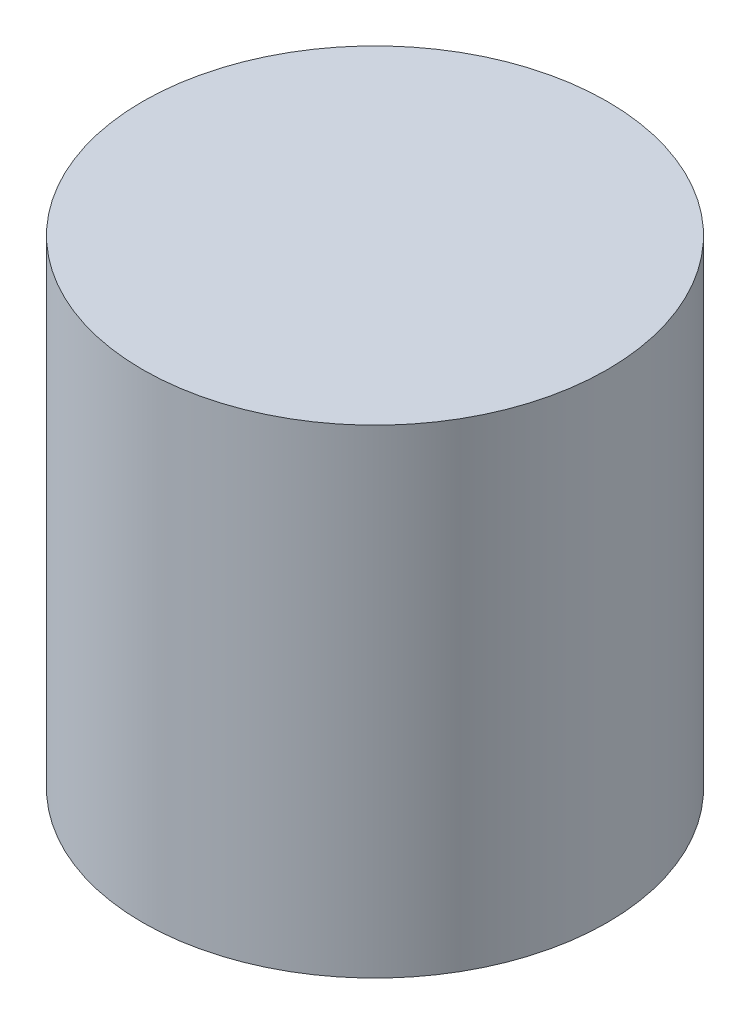
ISO-10303-21;
HEADER;
FILE_DESCRIPTION(('STEP AP214'),'2;1');
FILE_NAME('part.step','',(''),(''),'','','');
FILE_SCHEMA(('AUTOMOTIVE_DESIGN { 1 0 10303 214 1 1 1 1 }'));
ENDSEC;
DATA;
#1=APPLICATION_CONTEXT('core data for automotive mechanical design processes');
#2=APPLICATION_PROTOCOL_DEFINITION('international standard','automotive_design',2000,#1);
#3=PRODUCT_CONTEXT('',#1,'mechanical');
#4=PRODUCT('Part','Part','',(#3));
#5=PRODUCT_RELATED_PRODUCT_CATEGORY('part','',(#4));
#6=PRODUCT_DEFINITION_FORMATION('','',#4);
#7=PRODUCT_DEFINITION_CONTEXT('part definition',#1,'design');
#8=PRODUCT_DEFINITION('design','',#6,#7);
#9=PRODUCT_DEFINITION_SHAPE('','',#8);
#10=(LENGTH_UNIT() NAMED_UNIT(*) SI_UNIT(.MILLI.,.METRE.));
#11=(NAMED_UNIT(*) PLANE_ANGLE_UNIT() SI_UNIT($,.RADIAN.));
#12=(NAMED_UNIT(*) SI_UNIT($,.STERADIAN.) SOLID_ANGLE_UNIT());
#13=UNCERTAINTY_MEASURE_WITH_UNIT(LENGTH_MEASURE(1.E-05),#10,'distance_accuracy_value','');
#14=(GEOMETRIC_REPRESENTATION_CONTEXT(3) GLOBAL_UNCERTAINTY_ASSIGNED_CONTEXT((#13)) GLOBAL_UNIT_ASSIGNED_CONTEXT((#10,
#11,#12)) REPRESENTATION_CONTEXT('',''));
#15=CARTESIAN_POINT('',(0.,0.,0.));
#16=DIRECTION('',(0.,0.,1.));
#17=DIRECTION('',(1.,0.,0.));
#18=AXIS2_PLACEMENT_3D('',#15,#16,#17);
#19=CARTESIAN_POINT('',(287.174494692057,-68.25,-235.));
#20=DIRECTION('',(0.,1.,0.));
#21=DIRECTION('',(0.,0.,1.));
#22=AXIS2_PLACEMENT_3D('',#19,#20,#21);
#23=CYLINDRICAL_SURFACE('',#22,49.0000000000004);
#24=CARTESIAN_POINT('',(287.174494692057,-68.25,-235.));
#25=DIRECTION('',(0.,1.,0.));
#26=DIRECTION('',(0.,0.,1.));
#27=AXIS2_PLACEMENT_3D('',#24,#25,#26);
#28=CIRCLE('',#27,49.0000000000004);
#29=CARTESIAN_POINT('',(287.174494692057,-68.25,-186.));
#30=VERTEX_POINT('',#29);
#31=EDGE_CURVE('E10',#30,#30,#28,.T.);
#32=ORIENTED_EDGE('',*,*,#31,.T.);
#33=EDGE_LOOP('',(#32));
#34=FACE_BOUND('',#33,.T.);
#35=CARTESIAN_POINT('',(287.174494692057,32.75,-235.));
#36=DIRECTION('',(0.,1.,0.));
#37=DIRECTION('',(0.,0.,1.));
#38=AXIS2_PLACEMENT_3D('',#35,#36,#37);
#39=CIRCLE('',#38,49.0000000000004);
#40=CARTESIAN_POINT('',(287.174494692057,32.75,-186.));
#41=VERTEX_POINT('',#40);
#42=EDGE_CURVE('E34',#41,#41,#39,.T.);
#43=ORIENTED_EDGE('',*,*,#42,.F.);
#44=EDGE_LOOP('',(#43));
#45=FACE_BOUND('',#44,.T.);
#46=ADVANCED_FACE('F31',(#34,#45),#23,.T.);
#47=CARTESIAN_POINT('',(287.174494692057,-68.25,-235.));
#48=DIRECTION('',(0.,1.,0.));
#49=DIRECTION('',(0.,0.,1.));
#50=AXIS2_PLACEMENT_3D('',#47,#48,#49);
#51=PLANE('',#50);
#52=ORIENTED_EDGE('',*,*,#31,.F.);
#53=EDGE_LOOP('',(#52));
#54=FACE_BOUND('',#53,.T.);
#55=ADVANCED_FACE('F46',(#54),#51,.F.);
#56=CARTESIAN_POINT('',(287.174494692057,32.75,-235.));
#57=DIRECTION('',(0.,1.,0.));
#58=DIRECTION('',(0.,0.,1.));
#59=AXIS2_PLACEMENT_3D('',#56,#57,#58);
#60=PLANE('',#59);
#61=ORIENTED_EDGE('',*,*,#42,.T.);
#62=EDGE_LOOP('',(#61));
#63=FACE_BOUND('',#62,.T.);
#64=ADVANCED_FACE('F43',(#63),#60,.T.);
#65=CLOSED_SHELL('',(#46,#55,#64));
#66=MANIFOLD_SOLID_BREP('B2',#65);
#67=ADVANCED_BREP_SHAPE_REPRESENTATION('',(#18,#66),#14);
#68=SHAPE_DEFINITION_REPRESENTATION(#9,#67);
ENDSEC;
END-ISO-10303-21;
